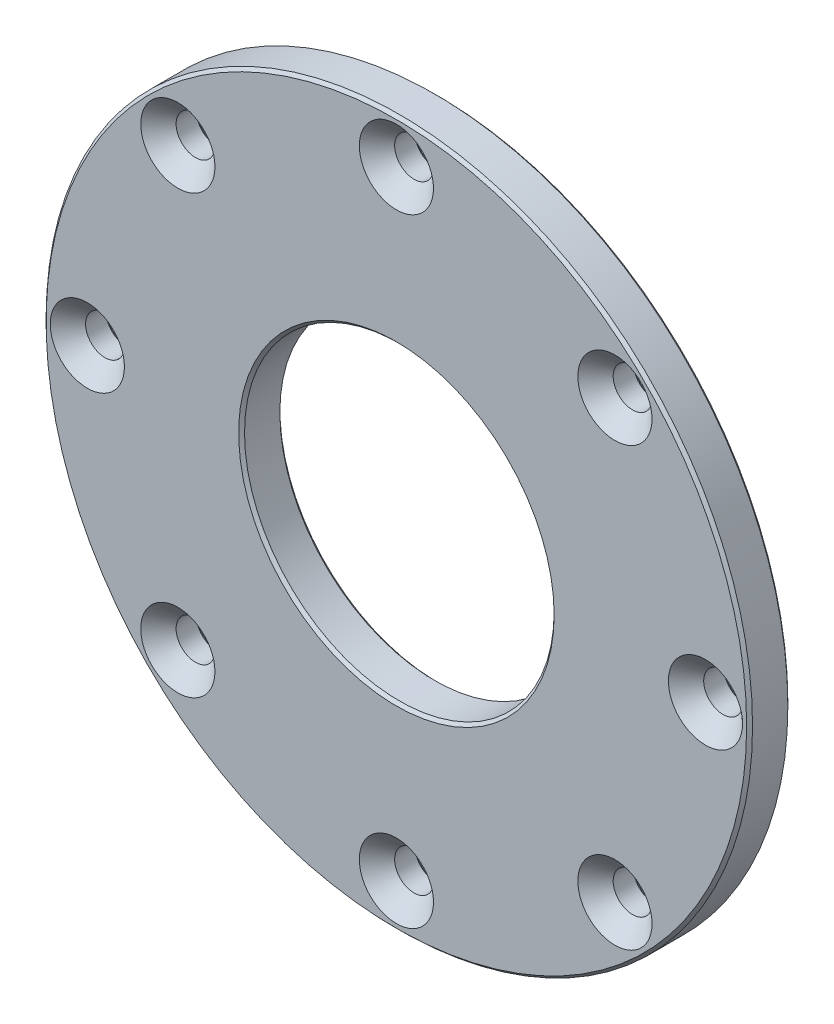
ISO-10303-21;
HEADER;
FILE_DESCRIPTION(('STEP AP214'),'2;1');
FILE_NAME('part.step','',(''),(''),'','','');
FILE_SCHEMA(('AUTOMOTIVE_DESIGN { 1 0 10303 214 1 1 1 1 }'));
ENDSEC;
DATA;
#1=APPLICATION_CONTEXT('core data for automotive mechanical design processes');
#2=APPLICATION_PROTOCOL_DEFINITION('international standard','automotive_design',2000,#1);
#3=PRODUCT_CONTEXT('',#1,'mechanical');
#4=PRODUCT('Part','Part','',(#3));
#5=PRODUCT_RELATED_PRODUCT_CATEGORY('part','',(#4));
#6=PRODUCT_DEFINITION_FORMATION('','',#4);
#7=PRODUCT_DEFINITION_CONTEXT('part definition',#1,'design');
#8=PRODUCT_DEFINITION('design','',#6,#7);
#9=PRODUCT_DEFINITION_SHAPE('','',#8);
#10=(LENGTH_UNIT() NAMED_UNIT(*) SI_UNIT(.MILLI.,.METRE.));
#11=(NAMED_UNIT(*) PLANE_ANGLE_UNIT() SI_UNIT($,.RADIAN.));
#12=(NAMED_UNIT(*) SI_UNIT($,.STERADIAN.) SOLID_ANGLE_UNIT());
#13=UNCERTAINTY_MEASURE_WITH_UNIT(LENGTH_MEASURE(1.E-05),#10,'distance_accuracy_value','');
#14=(GEOMETRIC_REPRESENTATION_CONTEXT(3) GLOBAL_UNCERTAINTY_ASSIGNED_CONTEXT((#13)) GLOBAL_UNIT_ASSIGNED_CONTEXT((#10,
#11,#12)) REPRESENTATION_CONTEXT('',''));
#15=CARTESIAN_POINT('',(0.,0.,0.));
#16=DIRECTION('',(0.,0.,1.));
#17=DIRECTION('',(1.,0.,0.));
#18=AXIS2_PLACEMENT_3D('',#15,#16,#17);
#19=CARTESIAN_POINT('',(0.,0.,7.));
#20=DIRECTION('',(0.,0.,1.));
#21=DIRECTION('',(1.,0.,0.));
#22=AXIS2_PLACEMENT_3D('',#19,#20,#21);
#23=PLANE('',#22);
#24=CARTESIAN_POINT('',(0.,0.,7.));
#25=DIRECTION('',(0.,0.,1.));
#26=DIRECTION('',(1.,0.,0.));
#27=AXIS2_PLACEMENT_3D('',#24,#25,#26);
#28=CIRCLE('',#27,59.5);
#29=CARTESIAN_POINT('',(59.5,0.,7.));
#30=VERTEX_POINT('',#29);
#31=EDGE_CURVE('E63',#30,#30,#28,.T.);
#32=ORIENTED_EDGE('',*,*,#31,.T.);
#33=EDGE_LOOP('',(#32));
#34=FACE_BOUND('',#33,.T.);
#35=CARTESIAN_POINT('',(0.,0.,7.));
#36=DIRECTION('',(0.,0.,1.));
#37=DIRECTION('',(1.,0.,0.));
#38=AXIS2_PLACEMENT_3D('',#35,#36,#37);
#39=CIRCLE('',#38,26.8);
#40=CARTESIAN_POINT('',(26.8,0.,7.));
#41=VERTEX_POINT('',#40);
#42=EDGE_CURVE('E70',#41,#41,#39,.F.);
#43=ORIENTED_EDGE('',*,*,#42,.T.);
#44=EDGE_LOOP('',(#43));
#45=FACE_BOUND('',#44,.T.);
#46=CARTESIAN_POINT('',(0.,52.5,7.));
#47=DIRECTION('',(0.,0.,1.));
#48=DIRECTION('',(1.,0.,0.));
#49=AXIS2_PLACEMENT_3D('',#46,#47,#48);
#50=CIRCLE('',#49,6.3);
#51=CARTESIAN_POINT('',(6.3,52.5,7.));
#52=VERTEX_POINT('',#51);
#53=EDGE_CURVE('E216',#52,#52,#50,.T.);
#54=ORIENTED_EDGE('',*,*,#53,.F.);
#55=EDGE_LOOP('',(#54));
#56=FACE_BOUND('',#55,.T.);
#57=CARTESIAN_POINT('',(37.1231060122937,37.1231060122937,7.));
#58=DIRECTION('',(0.,0.,1.));
#59=DIRECTION('',(1.,0.,0.));
#60=AXIS2_PLACEMENT_3D('',#57,#58,#59);
#61=CIRCLE('',#60,6.3);
#62=CARTESIAN_POINT('',(43.4231060122937,37.1231060122937,7.));
#63=VERTEX_POINT('',#62);
#64=EDGE_CURVE('E208',#63,#63,#61,.T.);
#65=ORIENTED_EDGE('',*,*,#64,.F.);
#66=EDGE_LOOP('',(#65));
#67=FACE_BOUND('',#66,.T.);
#68=CARTESIAN_POINT('',(52.5,0.,7.));
#69=DIRECTION('',(0.,0.,1.));
#70=DIRECTION('',(1.,0.,0.));
#71=AXIS2_PLACEMENT_3D('',#68,#69,#70);
#72=CIRCLE('',#71,6.3);
#73=CARTESIAN_POINT('',(58.8,0.,7.));
#74=VERTEX_POINT('',#73);
#75=EDGE_CURVE('E200',#74,#74,#72,.T.);
#76=ORIENTED_EDGE('',*,*,#75,.F.);
#77=EDGE_LOOP('',(#76));
#78=FACE_BOUND('',#77,.T.);
#79=CARTESIAN_POINT('',(37.1231060122937,-37.1231060122937,7.));
#80=DIRECTION('',(0.,0.,1.));
#81=DIRECTION('',(1.,0.,0.));
#82=AXIS2_PLACEMENT_3D('',#79,#80,#81);
#83=CIRCLE('',#82,6.3);
#84=CARTESIAN_POINT('',(43.4231060122937,-37.1231060122937,7.));
#85=VERTEX_POINT('',#84);
#86=EDGE_CURVE('E192',#85,#85,#83,.T.);
#87=ORIENTED_EDGE('',*,*,#86,.F.);
#88=EDGE_LOOP('',(#87));
#89=FACE_BOUND('',#88,.T.);
#90=CARTESIAN_POINT('',(0.,-52.5,7.));
#91=DIRECTION('',(0.,0.,1.));
#92=DIRECTION('',(1.,0.,0.));
#93=AXIS2_PLACEMENT_3D('',#90,#91,#92);
#94=CIRCLE('',#93,6.3);
#95=CARTESIAN_POINT('',(6.30000000000001,-52.5,7.));
#96=VERTEX_POINT('',#95);
#97=EDGE_CURVE('E184',#96,#96,#94,.T.);
#98=ORIENTED_EDGE('',*,*,#97,.F.);
#99=EDGE_LOOP('',(#98));
#100=FACE_BOUND('',#99,.T.);
#101=CARTESIAN_POINT('',(-37.1231060122937,-37.1231060122938,7.));
#102=DIRECTION('',(0.,0.,1.));
#103=DIRECTION('',(1.,0.,0.));
#104=AXIS2_PLACEMENT_3D('',#101,#102,#103);
#105=CIRCLE('',#104,6.3);
#106=CARTESIAN_POINT('',(-30.8231060122937,-37.1231060122938,7.));
#107=VERTEX_POINT('',#106);
#108=EDGE_CURVE('E176',#107,#107,#105,.T.);
#109=ORIENTED_EDGE('',*,*,#108,.F.);
#110=EDGE_LOOP('',(#109));
#111=FACE_BOUND('',#110,.T.);
#112=CARTESIAN_POINT('',(-52.5,0.,7.));
#113=DIRECTION('',(0.,0.,1.));
#114=DIRECTION('',(1.,0.,0.));
#115=AXIS2_PLACEMENT_3D('',#112,#113,#114);
#116=CIRCLE('',#115,6.3);
#117=CARTESIAN_POINT('',(-46.2,0.,7.));
#118=VERTEX_POINT('',#117);
#119=EDGE_CURVE('E168',#118,#118,#116,.T.);
#120=ORIENTED_EDGE('',*,*,#119,.F.);
#121=EDGE_LOOP('',(#120));
#122=FACE_BOUND('',#121,.T.);
#123=CARTESIAN_POINT('',(-37.1231060122937,37.1231060122937,7.));
#124=DIRECTION('',(0.,0.,1.));
#125=DIRECTION('',(1.,0.,0.));
#126=AXIS2_PLACEMENT_3D('',#123,#124,#125);
#127=CIRCLE('',#126,6.3);
#128=CARTESIAN_POINT('',(-30.8231060122937,37.1231060122937,7.));
#129=VERTEX_POINT('',#128);
#130=EDGE_CURVE('E160',#129,#129,#127,.T.);
#131=ORIENTED_EDGE('',*,*,#130,.F.);
#132=EDGE_LOOP('',(#131));
#133=FACE_BOUND('',#132,.T.);
#134=ADVANCED_FACE('F47',(#34,#45,#56,#67,#78,#89,#100,#111,#122,#133),#23,.T.);
#135=CARTESIAN_POINT('',(0.,0.,0.));
#136=DIRECTION('',(0.,0.,1.));
#137=DIRECTION('',(1.,0.,0.));
#138=AXIS2_PLACEMENT_3D('',#135,#136,#137);
#139=PLANE('',#138);
#140=CARTESIAN_POINT('',(-37.1231060122937,37.1231060122937,0.));
#141=DIRECTION('',(0.,0.,1.));
#142=DIRECTION('',(1.,0.,0.));
#143=AXIS2_PLACEMENT_3D('',#140,#141,#142);
#144=CIRCLE('',#143,3.79999999999998);
#145=CARTESIAN_POINT('',(-33.3231060122938,37.1231060122937,0.));
#146=VERTEX_POINT('',#145);
#147=EDGE_CURVE('E116',#146,#146,#144,.T.);
#148=ORIENTED_EDGE('',*,*,#147,.T.);
#149=EDGE_LOOP('',(#148));
#150=FACE_BOUND('',#149,.T.);
#151=CARTESIAN_POINT('',(-52.5,0.,0.));
#152=DIRECTION('',(0.,0.,1.));
#153=DIRECTION('',(1.,0.,0.));
#154=AXIS2_PLACEMENT_3D('',#151,#152,#153);
#155=CIRCLE('',#154,3.79999999999998);
#156=CARTESIAN_POINT('',(-48.7,0.,0.));
#157=VERTEX_POINT('',#156);
#158=EDGE_CURVE('E120',#157,#157,#155,.T.);
#159=ORIENTED_EDGE('',*,*,#158,.T.);
#160=EDGE_LOOP('',(#159));
#161=FACE_BOUND('',#160,.T.);
#162=CARTESIAN_POINT('',(-37.1231060122937,-37.1231060122938,0.));
#163=DIRECTION('',(0.,0.,1.));
#164=DIRECTION('',(1.,0.,0.));
#165=AXIS2_PLACEMENT_3D('',#162,#163,#164);
#166=CIRCLE('',#165,3.79999999999998);
#167=CARTESIAN_POINT('',(-33.3231060122938,-37.1231060122938,0.));
#168=VERTEX_POINT('',#167);
#169=EDGE_CURVE('E124',#168,#168,#166,.T.);
#170=ORIENTED_EDGE('',*,*,#169,.T.);
#171=EDGE_LOOP('',(#170));
#172=FACE_BOUND('',#171,.T.);
#173=CARTESIAN_POINT('',(0.,-52.5,0.));
#174=DIRECTION('',(0.,0.,1.));
#175=DIRECTION('',(1.,0.,0.));
#176=AXIS2_PLACEMENT_3D('',#173,#174,#175);
#177=CIRCLE('',#176,3.8);
#178=CARTESIAN_POINT('',(3.80000000000001,-52.5,0.));
#179=VERTEX_POINT('',#178);
#180=EDGE_CURVE('E128',#179,#179,#177,.T.);
#181=ORIENTED_EDGE('',*,*,#180,.T.);
#182=EDGE_LOOP('',(#181));
#183=FACE_BOUND('',#182,.T.);
#184=CARTESIAN_POINT('',(37.1231060122937,-37.1231060122937,0.));
#185=DIRECTION('',(0.,0.,1.));
#186=DIRECTION('',(1.,0.,0.));
#187=AXIS2_PLACEMENT_3D('',#184,#185,#186);
#188=CIRCLE('',#187,3.79999999999998);
#189=CARTESIAN_POINT('',(40.9231060122937,-37.1231060122937,0.));
#190=VERTEX_POINT('',#189);
#191=EDGE_CURVE('E132',#190,#190,#188,.T.);
#192=ORIENTED_EDGE('',*,*,#191,.T.);
#193=EDGE_LOOP('',(#192));
#194=FACE_BOUND('',#193,.T.);
#195=CARTESIAN_POINT('',(52.5,0.,0.));
#196=DIRECTION('',(0.,0.,1.));
#197=DIRECTION('',(1.,0.,0.));
#198=AXIS2_PLACEMENT_3D('',#195,#196,#197);
#199=CIRCLE('',#198,3.79999999999998);
#200=CARTESIAN_POINT('',(56.3,0.,0.));
#201=VERTEX_POINT('',#200);
#202=EDGE_CURVE('E136',#201,#201,#199,.T.);
#203=ORIENTED_EDGE('',*,*,#202,.T.);
#204=EDGE_LOOP('',(#203));
#205=FACE_BOUND('',#204,.T.);
#206=CARTESIAN_POINT('',(37.1231060122937,37.1231060122937,0.));
#207=DIRECTION('',(0.,0.,1.));
#208=DIRECTION('',(1.,0.,0.));
#209=AXIS2_PLACEMENT_3D('',#206,#207,#208);
#210=CIRCLE('',#209,3.79999999999998);
#211=CARTESIAN_POINT('',(40.9231060122937,37.1231060122937,0.));
#212=VERTEX_POINT('',#211);
#213=EDGE_CURVE('E140',#212,#212,#210,.T.);
#214=ORIENTED_EDGE('',*,*,#213,.T.);
#215=EDGE_LOOP('',(#214));
#216=FACE_BOUND('',#215,.T.);
#217=CARTESIAN_POINT('',(0.,52.5,0.));
#218=DIRECTION('',(0.,0.,1.));
#219=DIRECTION('',(1.,0.,0.));
#220=AXIS2_PLACEMENT_3D('',#217,#218,#219);
#221=CIRCLE('',#220,3.8);
#222=CARTESIAN_POINT('',(3.79999999999999,52.5,0.));
#223=VERTEX_POINT('',#222);
#224=EDGE_CURVE('E144',#223,#223,#221,.T.);
#225=ORIENTED_EDGE('',*,*,#224,.T.);
#226=EDGE_LOOP('',(#225));
#227=FACE_BOUND('',#226,.T.);
#228=CARTESIAN_POINT('',(0.,0.,0.));
#229=DIRECTION('',(0.,0.,1.));
#230=DIRECTION('',(1.,0.,0.));
#231=AXIS2_PLACEMENT_3D('',#228,#229,#230);
#232=CIRCLE('',#231,59.5);
#233=CARTESIAN_POINT('',(59.5,0.,0.));
#234=VERTEX_POINT('',#233);
#235=EDGE_CURVE('E148',#234,#234,#232,.F.);
#236=ORIENTED_EDGE('',*,*,#235,.T.);
#237=EDGE_LOOP('',(#236));
#238=FACE_BOUND('',#237,.T.);
#239=CARTESIAN_POINT('',(0.,0.,0.));
#240=DIRECTION('',(0.,0.,1.));
#241=DIRECTION('',(1.,0.,0.));
#242=AXIS2_PLACEMENT_3D('',#239,#240,#241);
#243=CIRCLE('',#242,26.8);
#244=CARTESIAN_POINT('',(26.8,0.,0.));
#245=VERTEX_POINT('',#244);
#246=EDGE_CURVE('E152',#245,#245,#243,.T.);
#247=ORIENTED_EDGE('',*,*,#246,.T.);
#248=EDGE_LOOP('',(#247));
#249=FACE_BOUND('',#248,.T.);
#250=ADVANCED_FACE('F227',(#150,#161,#172,#183,#194,#205,#216,#227,#238,#249),#139,.F.);
#251=CARTESIAN_POINT('',(0.,0.,7.));
#252=DIRECTION('',(0.,0.,-1.));
#253=DIRECTION('',(-1.,0.,0.));
#254=AXIS2_PLACEMENT_3D('',#251,#252,#253);
#255=CYLINDRICAL_SURFACE('',#254,60.);
#256=CARTESIAN_POINT('',(0.,0.,0.499999999999994));
#257=DIRECTION('',(0.,0.,1.));
#258=DIRECTION('',(1.,0.,0.));
#259=AXIS2_PLACEMENT_3D('',#256,#257,#258);
#260=CIRCLE('',#259,60.);
#261=CARTESIAN_POINT('',(60.,0.,0.499999999999994));
#262=VERTEX_POINT('',#261);
#263=EDGE_CURVE('E76',#262,#262,#260,.T.);
#264=ORIENTED_EDGE('',*,*,#263,.T.);
#265=EDGE_LOOP('',(#264));
#266=FACE_BOUND('',#265,.T.);
#267=CARTESIAN_POINT('',(0.,0.,6.50000000000005));
#268=DIRECTION('',(0.,0.,1.));
#269=DIRECTION('',(1.,0.,0.));
#270=AXIS2_PLACEMENT_3D('',#267,#268,#269);
#271=CIRCLE('',#270,60.);
#272=CARTESIAN_POINT('',(60.,0.,6.50000000000005));
#273=VERTEX_POINT('',#272);
#274=EDGE_CURVE('E80',#273,#273,#271,.F.);
#275=ORIENTED_EDGE('',*,*,#274,.T.);
#276=EDGE_LOOP('',(#275));
#277=FACE_BOUND('',#276,.T.);
#278=ADVANCED_FACE('F265',(#266,#277),#255,.T.);
#279=CARTESIAN_POINT('',(0.,0.,7.));
#280=DIRECTION('',(0.,0.,-1.));
#281=DIRECTION('',(-1.,0.,0.));
#282=AXIS2_PLACEMENT_3D('',#279,#280,#281);
#283=CYLINDRICAL_SURFACE('',#282,26.3);
#284=CARTESIAN_POINT('',(0.,0.,0.500000000000035));
#285=DIRECTION('',(0.,0.,1.));
#286=DIRECTION('',(1.,0.,0.));
#287=AXIS2_PLACEMENT_3D('',#284,#285,#286);
#288=CIRCLE('',#287,26.3);
#289=CARTESIAN_POINT('',(26.3,0.,0.500000000000035));
#290=VERTEX_POINT('',#289);
#291=EDGE_CURVE('E10',#290,#290,#288,.F.);
#292=ORIENTED_EDGE('',*,*,#291,.T.);
#293=EDGE_LOOP('',(#292));
#294=FACE_BOUND('',#293,.T.);
#295=CARTESIAN_POINT('',(0.,0.,6.5));
#296=DIRECTION('',(0.,0.,1.));
#297=DIRECTION('',(1.,0.,0.));
#298=AXIS2_PLACEMENT_3D('',#295,#296,#297);
#299=CIRCLE('',#298,26.3);
#300=CARTESIAN_POINT('',(26.3,0.,6.5));
#301=VERTEX_POINT('',#300);
#302=EDGE_CURVE('E56',#301,#301,#299,.T.);
#303=ORIENTED_EDGE('',*,*,#302,.T.);
#304=EDGE_LOOP('',(#303));
#305=FACE_BOUND('',#304,.T.);
#306=ADVANCED_FACE('F258',(#294,#305),#283,.F.);
#307=CARTESIAN_POINT('',(-37.1231060122937,37.1231060122937,7.));
#308=DIRECTION('',(0.,0.,1.));
#309=DIRECTION('',(1.,0.,0.));
#310=AXIS2_PLACEMENT_3D('',#307,#308,#309);
#311=CYLINDRICAL_SURFACE('',#310,3.3);
#312=CARTESIAN_POINT('',(-37.1231060122937,37.1231060122937,0.499999999999984));
#313=DIRECTION('',(0.,0.,1.));
#314=DIRECTION('',(1.,0.,0.));
#315=AXIS2_PLACEMENT_3D('',#312,#313,#314);
#316=CIRCLE('',#315,3.3);
#317=CARTESIAN_POINT('',(-33.8231060122937,37.1231060122937,0.499999999999984));
#318=VERTEX_POINT('',#317);
#319=EDGE_CURVE('E112',#318,#318,#316,.F.);
#320=ORIENTED_EDGE('',*,*,#319,.T.);
#321=EDGE_LOOP('',(#320));
#322=FACE_BOUND('',#321,.T.);
#323=CARTESIAN_POINT('',(-37.1231060122937,37.1231060122937,4.));
#324=DIRECTION('',(0.,0.,1.));
#325=DIRECTION('',(1.,0.,0.));
#326=AXIS2_PLACEMENT_3D('',#323,#324,#325);
#327=CIRCLE('',#326,3.3);
#328=CARTESIAN_POINT('',(-33.8231060122937,37.1231060122937,4.));
#329=VERTEX_POINT('',#328);
#330=EDGE_CURVE('E156',#329,#329,#327,.T.);
#331=ORIENTED_EDGE('',*,*,#330,.T.);
#332=EDGE_LOOP('',(#331));
#333=FACE_BOUND('',#332,.T.);
#334=ADVANCED_FACE('F247',(#322,#333),#311,.F.);
#335=CARTESIAN_POINT('',(-37.1231060122937,37.1231060122937,7.));
#336=DIRECTION('',(0.,0.,1.));
#337=DIRECTION('',(1.,0.,0.));
#338=AXIS2_PLACEMENT_3D('',#335,#336,#337);
#339=CONICAL_SURFACE('',#338,6.3,0.785398163397449);
#340=ORIENTED_EDGE('',*,*,#330,.F.);
#341=EDGE_LOOP('',(#340));
#342=FACE_BOUND('',#341,.T.);
#343=ORIENTED_EDGE('',*,*,#130,.T.);
#344=EDGE_LOOP('',(#343));
#345=FACE_BOUND('',#344,.T.);
#346=ADVANCED_FACE('F244',(#342,#345),#339,.F.);
#347=CARTESIAN_POINT('',(-52.5,0.,7.));
#348=DIRECTION('',(0.,0.,1.));
#349=DIRECTION('',(1.,0.,0.));
#350=AXIS2_PLACEMENT_3D('',#347,#348,#349);
#351=CYLINDRICAL_SURFACE('',#350,3.3);
#352=CARTESIAN_POINT('',(-52.5,0.,0.499999999999984));
#353=DIRECTION('',(0.,0.,1.));
#354=DIRECTION('',(1.,0.,0.));
#355=AXIS2_PLACEMENT_3D('',#352,#353,#354);
#356=CIRCLE('',#355,3.3);
#357=CARTESIAN_POINT('',(-49.2,0.,0.499999999999984));
#358=VERTEX_POINT('',#357);
#359=EDGE_CURVE('E108',#358,#358,#356,.F.);
#360=ORIENTED_EDGE('',*,*,#359,.T.);
#361=EDGE_LOOP('',(#360));
#362=FACE_BOUND('',#361,.T.);
#363=CARTESIAN_POINT('',(-52.5,0.,4.));
#364=DIRECTION('',(0.,0.,1.));
#365=DIRECTION('',(1.,0.,0.));
#366=AXIS2_PLACEMENT_3D('',#363,#364,#365);
#367=CIRCLE('',#366,3.3);
#368=CARTESIAN_POINT('',(-49.2,0.,4.));
#369=VERTEX_POINT('',#368);
#370=EDGE_CURVE('E164',#369,#369,#367,.T.);
#371=ORIENTED_EDGE('',*,*,#370,.T.);
#372=EDGE_LOOP('',(#371));
#373=FACE_BOUND('',#372,.T.);
#374=ADVANCED_FACE('F246',(#362,#373),#351,.F.);
#375=CARTESIAN_POINT('',(-52.5,0.,7.));
#376=DIRECTION('',(0.,0.,1.));
#377=DIRECTION('',(1.,0.,0.));
#378=AXIS2_PLACEMENT_3D('',#375,#376,#377);
#379=CONICAL_SURFACE('',#378,6.3,0.785398163397449);
#380=ORIENTED_EDGE('',*,*,#370,.F.);
#381=EDGE_LOOP('',(#380));
#382=FACE_BOUND('',#381,.T.);
#383=ORIENTED_EDGE('',*,*,#119,.T.);
#384=EDGE_LOOP('',(#383));
#385=FACE_BOUND('',#384,.T.);
#386=ADVANCED_FACE('F254',(#382,#385),#379,.F.);
#387=CARTESIAN_POINT('',(-37.1231060122937,-37.1231060122938,7.));
#388=DIRECTION('',(0.,0.,1.));
#389=DIRECTION('',(1.,0.,0.));
#390=AXIS2_PLACEMENT_3D('',#387,#388,#389);
#391=CYLINDRICAL_SURFACE('',#390,3.3);
#392=CARTESIAN_POINT('',(-37.1231060122937,-37.1231060122938,0.499999999999984));
#393=DIRECTION('',(0.,0.,1.));
#394=DIRECTION('',(1.,0.,0.));
#395=AXIS2_PLACEMENT_3D('',#392,#393,#394);
#396=CIRCLE('',#395,3.3);
#397=CARTESIAN_POINT('',(-33.8231060122937,-37.1231060122938,0.499999999999984));
#398=VERTEX_POINT('',#397);
#399=EDGE_CURVE('E104',#398,#398,#396,.F.);
#400=ORIENTED_EDGE('',*,*,#399,.T.);
#401=EDGE_LOOP('',(#400));
#402=FACE_BOUND('',#401,.T.);
#403=CARTESIAN_POINT('',(-37.1231060122937,-37.1231060122938,4.));
#404=DIRECTION('',(0.,0.,1.));
#405=DIRECTION('',(1.,0.,0.));
#406=AXIS2_PLACEMENT_3D('',#403,#404,#405);
#407=CIRCLE('',#406,3.3);
#408=CARTESIAN_POINT('',(-33.8231060122937,-37.1231060122938,4.));
#409=VERTEX_POINT('',#408);
#410=EDGE_CURVE('E172',#409,#409,#407,.T.);
#411=ORIENTED_EDGE('',*,*,#410,.T.);
#412=EDGE_LOOP('',(#411));
#413=FACE_BOUND('',#412,.T.);
#414=ADVANCED_FACE('F535',(#402,#413),#391,.F.);
#415=CARTESIAN_POINT('',(-37.1231060122937,-37.1231060122938,7.));
#416=DIRECTION('',(0.,0.,1.));
#417=DIRECTION('',(1.,0.,0.));
#418=AXIS2_PLACEMENT_3D('',#415,#416,#417);
#419=CONICAL_SURFACE('',#418,6.3,0.785398163397449);
#420=ORIENTED_EDGE('',*,*,#410,.F.);
#421=EDGE_LOOP('',(#420));
#422=FACE_BOUND('',#421,.T.);
#423=ORIENTED_EDGE('',*,*,#108,.T.);
#424=EDGE_LOOP('',(#423));
#425=FACE_BOUND('',#424,.T.);
#426=ADVANCED_FACE('F525',(#422,#425),#419,.F.);
#427=CARTESIAN_POINT('',(0.,-52.5,7.));
#428=DIRECTION('',(0.,0.,1.));
#429=DIRECTION('',(1.,0.,0.));
#430=AXIS2_PLACEMENT_3D('',#427,#428,#429);
#431=CYLINDRICAL_SURFACE('',#430,3.3);
#432=CARTESIAN_POINT('',(0.,-52.5,0.500000000000015));
#433=DIRECTION('',(0.,0.,1.));
#434=DIRECTION('',(1.,0.,0.));
#435=AXIS2_PLACEMENT_3D('',#432,#433,#434);
#436=CIRCLE('',#435,3.3);
#437=CARTESIAN_POINT('',(3.30000000000001,-52.5,0.500000000000015));
#438=VERTEX_POINT('',#437);
#439=EDGE_CURVE('E100',#438,#438,#436,.F.);
#440=ORIENTED_EDGE('',*,*,#439,.T.);
#441=EDGE_LOOP('',(#440));
#442=FACE_BOUND('',#441,.T.);
#443=CARTESIAN_POINT('',(0.,-52.5,4.));
#444=DIRECTION('',(0.,0.,1.));
#445=DIRECTION('',(1.,0.,0.));
#446=AXIS2_PLACEMENT_3D('',#443,#444,#445);
#447=CIRCLE('',#446,3.3);
#448=CARTESIAN_POINT('',(3.30000000000001,-52.5,4.));
#449=VERTEX_POINT('',#448);
#450=EDGE_CURVE('E180',#449,#449,#447,.T.);
#451=ORIENTED_EDGE('',*,*,#450,.T.);
#452=EDGE_LOOP('',(#451));
#453=FACE_BOUND('',#452,.T.);
#454=ADVANCED_FACE('F515',(#442,#453),#431,.F.);
#455=CARTESIAN_POINT('',(0.,-52.5,7.));
#456=DIRECTION('',(0.,0.,1.));
#457=DIRECTION('',(1.,0.,0.));
#458=AXIS2_PLACEMENT_3D('',#455,#456,#457);
#459=CONICAL_SURFACE('',#458,6.3,0.785398163397448);
#460=ORIENTED_EDGE('',*,*,#450,.F.);
#461=EDGE_LOOP('',(#460));
#462=FACE_BOUND('',#461,.T.);
#463=ORIENTED_EDGE('',*,*,#97,.T.);
#464=EDGE_LOOP('',(#463));
#465=FACE_BOUND('',#464,.T.);
#466=ADVANCED_FACE('F505',(#462,#465),#459,.F.);
#467=CARTESIAN_POINT('',(37.1231060122937,-37.1231060122937,7.));
#468=DIRECTION('',(0.,0.,1.));
#469=DIRECTION('',(1.,0.,0.));
#470=AXIS2_PLACEMENT_3D('',#467,#468,#469);
#471=CYLINDRICAL_SURFACE('',#470,3.3);
#472=CARTESIAN_POINT('',(37.1231060122937,-37.1231060122937,0.499999999999984));
#473=DIRECTION('',(0.,0.,1.));
#474=DIRECTION('',(1.,0.,0.));
#475=AXIS2_PLACEMENT_3D('',#472,#473,#474);
#476=CIRCLE('',#475,3.3);
#477=CARTESIAN_POINT('',(40.4231060122937,-37.1231060122937,0.499999999999984));
#478=VERTEX_POINT('',#477);
#479=EDGE_CURVE('E96',#478,#478,#476,.F.);
#480=ORIENTED_EDGE('',*,*,#479,.T.);
#481=EDGE_LOOP('',(#480));
#482=FACE_BOUND('',#481,.T.);
#483=CARTESIAN_POINT('',(37.1231060122937,-37.1231060122937,4.));
#484=DIRECTION('',(0.,0.,1.));
#485=DIRECTION('',(1.,0.,0.));
#486=AXIS2_PLACEMENT_3D('',#483,#484,#485);
#487=CIRCLE('',#486,3.3);
#488=CARTESIAN_POINT('',(40.4231060122937,-37.1231060122937,4.));
#489=VERTEX_POINT('',#488);
#490=EDGE_CURVE('E188',#489,#489,#487,.T.);
#491=ORIENTED_EDGE('',*,*,#490,.T.);
#492=EDGE_LOOP('',(#491));
#493=FACE_BOUND('',#492,.T.);
#494=ADVANCED_FACE('F495',(#482,#493),#471,.F.);
#495=CARTESIAN_POINT('',(37.1231060122937,-37.1231060122937,7.));
#496=DIRECTION('',(0.,0.,1.));
#497=DIRECTION('',(1.,0.,0.));
#498=AXIS2_PLACEMENT_3D('',#495,#496,#497);
#499=CONICAL_SURFACE('',#498,6.3,0.785398163397449);
#500=ORIENTED_EDGE('',*,*,#490,.F.);
#501=EDGE_LOOP('',(#500));
#502=FACE_BOUND('',#501,.T.);
#503=ORIENTED_EDGE('',*,*,#86,.T.);
#504=EDGE_LOOP('',(#503));
#505=FACE_BOUND('',#504,.T.);
#506=ADVANCED_FACE('F485',(#502,#505),#499,.F.);
#507=CARTESIAN_POINT('',(52.5,0.,7.));
#508=DIRECTION('',(0.,0.,1.));
#509=DIRECTION('',(1.,0.,0.));
#510=AXIS2_PLACEMENT_3D('',#507,#508,#509);
#511=CYLINDRICAL_SURFACE('',#510,3.3);
#512=CARTESIAN_POINT('',(52.5,0.,0.499999999999984));
#513=DIRECTION('',(0.,0.,1.));
#514=DIRECTION('',(1.,0.,0.));
#515=AXIS2_PLACEMENT_3D('',#512,#513,#514);
#516=CIRCLE('',#515,3.3);
#517=CARTESIAN_POINT('',(55.8,0.,0.499999999999984));
#518=VERTEX_POINT('',#517);
#519=EDGE_CURVE('E92',#518,#518,#516,.F.);
#520=ORIENTED_EDGE('',*,*,#519,.T.);
#521=EDGE_LOOP('',(#520));
#522=FACE_BOUND('',#521,.T.);
#523=CARTESIAN_POINT('',(52.5,0.,4.));
#524=DIRECTION('',(0.,0.,1.));
#525=DIRECTION('',(1.,0.,0.));
#526=AXIS2_PLACEMENT_3D('',#523,#524,#525);
#527=CIRCLE('',#526,3.3);
#528=CARTESIAN_POINT('',(55.8,0.,4.));
#529=VERTEX_POINT('',#528);
#530=EDGE_CURVE('E196',#529,#529,#527,.T.);
#531=ORIENTED_EDGE('',*,*,#530,.T.);
#532=EDGE_LOOP('',(#531));
#533=FACE_BOUND('',#532,.T.);
#534=ADVANCED_FACE('F475',(#522,#533),#511,.F.);
#535=CARTESIAN_POINT('',(52.5,0.,7.));
#536=DIRECTION('',(0.,0.,1.));
#537=DIRECTION('',(1.,0.,0.));
#538=AXIS2_PLACEMENT_3D('',#535,#536,#537);
#539=CONICAL_SURFACE('',#538,6.3,0.785398163397449);
#540=ORIENTED_EDGE('',*,*,#530,.F.);
#541=EDGE_LOOP('',(#540));
#542=FACE_BOUND('',#541,.T.);
#543=ORIENTED_EDGE('',*,*,#75,.T.);
#544=EDGE_LOOP('',(#543));
#545=FACE_BOUND('',#544,.T.);
#546=ADVANCED_FACE('F465',(#542,#545),#539,.F.);
#547=CARTESIAN_POINT('',(37.1231060122937,37.1231060122937,7.));
#548=DIRECTION('',(0.,0.,1.));
#549=DIRECTION('',(1.,0.,0.));
#550=AXIS2_PLACEMENT_3D('',#547,#548,#549);
#551=CYLINDRICAL_SURFACE('',#550,3.3);
#552=CARTESIAN_POINT('',(37.1231060122937,37.1231060122937,0.499999999999984));
#553=DIRECTION('',(0.,0.,1.));
#554=DIRECTION('',(1.,0.,0.));
#555=AXIS2_PLACEMENT_3D('',#552,#553,#554);
#556=CIRCLE('',#555,3.3);
#557=CARTESIAN_POINT('',(40.4231060122937,37.1231060122937,0.499999999999984));
#558=VERTEX_POINT('',#557);
#559=EDGE_CURVE('E88',#558,#558,#556,.F.);
#560=ORIENTED_EDGE('',*,*,#559,.T.);
#561=EDGE_LOOP('',(#560));
#562=FACE_BOUND('',#561,.T.);
#563=CARTESIAN_POINT('',(37.1231060122937,37.1231060122937,4.));
#564=DIRECTION('',(0.,0.,1.));
#565=DIRECTION('',(1.,0.,0.));
#566=AXIS2_PLACEMENT_3D('',#563,#564,#565);
#567=CIRCLE('',#566,3.3);
#568=CARTESIAN_POINT('',(40.4231060122937,37.1231060122937,4.));
#569=VERTEX_POINT('',#568);
#570=EDGE_CURVE('E204',#569,#569,#567,.T.);
#571=ORIENTED_EDGE('',*,*,#570,.T.);
#572=EDGE_LOOP('',(#571));
#573=FACE_BOUND('',#572,.T.);
#574=ADVANCED_FACE('F455',(#562,#573),#551,.F.);
#575=CARTESIAN_POINT('',(37.1231060122937,37.1231060122937,7.));
#576=DIRECTION('',(0.,0.,1.));
#577=DIRECTION('',(1.,0.,0.));
#578=AXIS2_PLACEMENT_3D('',#575,#576,#577);
#579=CONICAL_SURFACE('',#578,6.3,0.785398163397449);
#580=ORIENTED_EDGE('',*,*,#570,.F.);
#581=EDGE_LOOP('',(#580));
#582=FACE_BOUND('',#581,.T.);
#583=ORIENTED_EDGE('',*,*,#64,.T.);
#584=EDGE_LOOP('',(#583));
#585=FACE_BOUND('',#584,.T.);
#586=ADVANCED_FACE('F445',(#582,#585),#579,.F.);
#587=CARTESIAN_POINT('',(0.,52.5,7.));
#588=DIRECTION('',(0.,0.,1.));
#589=DIRECTION('',(1.,0.,0.));
#590=AXIS2_PLACEMENT_3D('',#587,#588,#589);
#591=CYLINDRICAL_SURFACE('',#590,3.3);
#592=CARTESIAN_POINT('',(0.,52.5,0.500000000000015));
#593=DIRECTION('',(0.,0.,1.));
#594=DIRECTION('',(1.,0.,0.));
#595=AXIS2_PLACEMENT_3D('',#592,#593,#594);
#596=CIRCLE('',#595,3.3);
#597=CARTESIAN_POINT('',(3.29999999999999,52.5,0.500000000000015));
#598=VERTEX_POINT('',#597);
#599=EDGE_CURVE('E84',#598,#598,#596,.F.);
#600=ORIENTED_EDGE('',*,*,#599,.T.);
#601=EDGE_LOOP('',(#600));
#602=FACE_BOUND('',#601,.T.);
#603=CARTESIAN_POINT('',(0.,52.5,4.));
#604=DIRECTION('',(0.,0.,1.));
#605=DIRECTION('',(1.,0.,0.));
#606=AXIS2_PLACEMENT_3D('',#603,#604,#605);
#607=CIRCLE('',#606,3.3);
#608=CARTESIAN_POINT('',(3.3,52.5,4.));
#609=VERTEX_POINT('',#608);
#610=EDGE_CURVE('E212',#609,#609,#607,.T.);
#611=ORIENTED_EDGE('',*,*,#610,.T.);
#612=EDGE_LOOP('',(#611));
#613=FACE_BOUND('',#612,.T.);
#614=ADVANCED_FACE('F435',(#602,#613),#591,.F.);
#615=CARTESIAN_POINT('',(0.,52.5,7.));
#616=DIRECTION('',(0.,0.,1.));
#617=DIRECTION('',(1.,0.,0.));
#618=AXIS2_PLACEMENT_3D('',#615,#616,#617);
#619=CONICAL_SURFACE('',#618,6.3,0.785398163397448);
#620=ORIENTED_EDGE('',*,*,#610,.F.);
#621=EDGE_LOOP('',(#620));
#622=FACE_BOUND('',#621,.T.);
#623=ORIENTED_EDGE('',*,*,#53,.T.);
#624=EDGE_LOOP('',(#623));
#625=FACE_BOUND('',#624,.T.);
#626=ADVANCED_FACE('F223',(#622,#625),#619,.F.);
#627=CARTESIAN_POINT('',(-37.1231060122937,37.1231060122937,0.));
#628=DIRECTION('',(0.,0.,-1.));
#629=DIRECTION('',(-1.,0.,0.));
#630=AXIS2_PLACEMENT_3D('',#627,#628,#629);
#631=CONICAL_SURFACE('',#630,3.79999999999998,0.785398163397451);
#632=ORIENTED_EDGE('',*,*,#319,.F.);
#633=EDGE_LOOP('',(#632));
#634=FACE_BOUND('',#633,.T.);
#635=ORIENTED_EDGE('',*,*,#147,.F.);
#636=EDGE_LOOP('',(#635));
#637=FACE_BOUND('',#636,.T.);
#638=ADVANCED_FACE('F274',(#634,#637),#631,.F.);
#639=CARTESIAN_POINT('',(-52.5,0.,0.));
#640=DIRECTION('',(0.,0.,-1.));
#641=DIRECTION('',(-1.,0.,0.));
#642=AXIS2_PLACEMENT_3D('',#639,#640,#641);
#643=CONICAL_SURFACE('',#642,3.79999999999998,0.785398163397451);
#644=ORIENTED_EDGE('',*,*,#359,.F.);
#645=EDGE_LOOP('',(#644));
#646=FACE_BOUND('',#645,.T.);
#647=ORIENTED_EDGE('',*,*,#158,.F.);
#648=EDGE_LOOP('',(#647));
#649=FACE_BOUND('',#648,.T.);
#650=ADVANCED_FACE('F280',(#646,#649),#643,.F.);
#651=CARTESIAN_POINT('',(-37.1231060122937,-37.1231060122938,0.));
#652=DIRECTION('',(0.,0.,-1.));
#653=DIRECTION('',(-1.,0.,0.));
#654=AXIS2_PLACEMENT_3D('',#651,#652,#653);
#655=CONICAL_SURFACE('',#654,3.79999999999998,0.785398163397451);
#656=ORIENTED_EDGE('',*,*,#399,.F.);
#657=EDGE_LOOP('',(#656));
#658=FACE_BOUND('',#657,.T.);
#659=ORIENTED_EDGE('',*,*,#169,.F.);
#660=EDGE_LOOP('',(#659));
#661=FACE_BOUND('',#660,.T.);
#662=ADVANCED_FACE('F287',(#658,#661),#655,.F.);
#663=CARTESIAN_POINT('',(0.,-52.5,0.));
#664=DIRECTION('',(0.,0.,-1.));
#665=DIRECTION('',(-1.,0.,0.));
#666=AXIS2_PLACEMENT_3D('',#663,#664,#665);
#667=CONICAL_SURFACE('',#666,3.8,0.785398163397432);
#668=ORIENTED_EDGE('',*,*,#439,.F.);
#669=EDGE_LOOP('',(#668));
#670=FACE_BOUND('',#669,.T.);
#671=ORIENTED_EDGE('',*,*,#180,.F.);
#672=EDGE_LOOP('',(#671));
#673=FACE_BOUND('',#672,.T.);
#674=ADVANCED_FACE('F294',(#670,#673),#667,.F.);
#675=CARTESIAN_POINT('',(37.1231060122937,-37.1231060122937,0.));
#676=DIRECTION('',(0.,0.,-1.));
#677=DIRECTION('',(-1.,0.,0.));
#678=AXIS2_PLACEMENT_3D('',#675,#676,#677);
#679=CONICAL_SURFACE('',#678,3.79999999999998,0.785398163397451);
#680=ORIENTED_EDGE('',*,*,#479,.F.);
#681=EDGE_LOOP('',(#680));
#682=FACE_BOUND('',#681,.T.);
#683=ORIENTED_EDGE('',*,*,#191,.F.);
#684=EDGE_LOOP('',(#683));
#685=FACE_BOUND('',#684,.T.);
#686=ADVANCED_FACE('F301',(#682,#685),#679,.F.);
#687=CARTESIAN_POINT('',(52.5,0.,0.));
#688=DIRECTION('',(0.,0.,-1.));
#689=DIRECTION('',(-1.,0.,0.));
#690=AXIS2_PLACEMENT_3D('',#687,#688,#689);
#691=CONICAL_SURFACE('',#690,3.79999999999998,0.785398163397451);
#692=ORIENTED_EDGE('',*,*,#519,.F.);
#693=EDGE_LOOP('',(#692));
#694=FACE_BOUND('',#693,.T.);
#695=ORIENTED_EDGE('',*,*,#202,.F.);
#696=EDGE_LOOP('',(#695));
#697=FACE_BOUND('',#696,.T.);
#698=ADVANCED_FACE('F308',(#694,#697),#691,.F.);
#699=CARTESIAN_POINT('',(37.1231060122937,37.1231060122937,0.));
#700=DIRECTION('',(0.,0.,-1.));
#701=DIRECTION('',(-1.,0.,0.));
#702=AXIS2_PLACEMENT_3D('',#699,#700,#701);
#703=CONICAL_SURFACE('',#702,3.79999999999998,0.785398163397451);
#704=ORIENTED_EDGE('',*,*,#559,.F.);
#705=EDGE_LOOP('',(#704));
#706=FACE_BOUND('',#705,.T.);
#707=ORIENTED_EDGE('',*,*,#213,.F.);
#708=EDGE_LOOP('',(#707));
#709=FACE_BOUND('',#708,.T.);
#710=ADVANCED_FACE('F315',(#706,#709),#703,.F.);
#711=CARTESIAN_POINT('',(0.,52.5,0.));
#712=DIRECTION('',(0.,0.,-1.));
#713=DIRECTION('',(-1.,0.,0.));
#714=AXIS2_PLACEMENT_3D('',#711,#712,#713);
#715=CONICAL_SURFACE('',#714,3.8,0.785398163397432);
#716=ORIENTED_EDGE('',*,*,#599,.F.);
#717=EDGE_LOOP('',(#716));
#718=FACE_BOUND('',#717,.T.);
#719=ORIENTED_EDGE('',*,*,#224,.F.);
#720=EDGE_LOOP('',(#719));
#721=FACE_BOUND('',#720,.T.);
#722=ADVANCED_FACE('F322',(#718,#721),#715,.F.);
#723=CARTESIAN_POINT('',(0.,0.,0.499999999999994));
#724=DIRECTION('',(0.,0.,1.));
#725=DIRECTION('',(1.,0.,0.));
#726=AXIS2_PLACEMENT_3D('',#723,#724,#725);
#727=CONICAL_SURFACE('',#726,60.,0.785398163397448);
#728=ORIENTED_EDGE('',*,*,#235,.F.);
#729=EDGE_LOOP('',(#728));
#730=FACE_BOUND('',#729,.T.);
#731=ORIENTED_EDGE('',*,*,#263,.F.);
#732=EDGE_LOOP('',(#731));
#733=FACE_BOUND('',#732,.T.);
#734=ADVANCED_FACE('F329',(#730,#733),#727,.T.);
#735=CARTESIAN_POINT('',(0.,0.,7.));
#736=DIRECTION('',(0.,0.,-1.));
#737=DIRECTION('',(-1.,0.,0.));
#738=AXIS2_PLACEMENT_3D('',#735,#736,#737);
#739=CONICAL_SURFACE('',#738,59.5,0.785398163397462);
#740=ORIENTED_EDGE('',*,*,#274,.F.);
#741=EDGE_LOOP('',(#740));
#742=FACE_BOUND('',#741,.T.);
#743=ORIENTED_EDGE('',*,*,#31,.F.);
#744=EDGE_LOOP('',(#743));
#745=FACE_BOUND('',#744,.T.);
#746=ADVANCED_FACE('F336',(#742,#745),#739,.T.);
#747=CARTESIAN_POINT('',(0.,0.,0.));
#748=DIRECTION('',(0.,0.,-1.));
#749=DIRECTION('',(-1.,0.,0.));
#750=AXIS2_PLACEMENT_3D('',#747,#748,#749);
#751=CONICAL_SURFACE('',#750,26.8,0.785398163397445);
#752=ORIENTED_EDGE('',*,*,#291,.F.);
#753=EDGE_LOOP('',(#752));
#754=FACE_BOUND('',#753,.T.);
#755=ORIENTED_EDGE('',*,*,#246,.F.);
#756=EDGE_LOOP('',(#755));
#757=FACE_BOUND('',#756,.T.);
#758=ADVANCED_FACE('F342',(#754,#757),#751,.F.);
#759=CARTESIAN_POINT('',(0.,0.,6.5));
#760=DIRECTION('',(0.,0.,1.));
#761=DIRECTION('',(1.,0.,0.));
#762=AXIS2_PLACEMENT_3D('',#759,#760,#761);
#763=CONICAL_SURFACE('',#762,26.3,0.785398163397441);
#764=ORIENTED_EDGE('',*,*,#42,.F.);
#765=EDGE_LOOP('',(#764));
#766=FACE_BOUND('',#765,.T.);
#767=ORIENTED_EDGE('',*,*,#302,.F.);
#768=EDGE_LOOP('',(#767));
#769=FACE_BOUND('',#768,.T.);
#770=ADVANCED_FACE('F50',(#766,#769),#763,.F.);
#771=CLOSED_SHELL('',(#134,#250,#278,#306,#334,#346,#374,#386,#414,#426,#454,#466,#494,#506,
#534,#546,#574,#586,#614,#626,#638,#650,#662,#674,#686,#698,#710,#722,#734,#746,#758,#770));
#772=MANIFOLD_SOLID_BREP('B2',#771);
#773=ADVANCED_BREP_SHAPE_REPRESENTATION('',(#18,#772),#14);
#774=SHAPE_DEFINITION_REPRESENTATION(#9,#773);
ENDSEC;
END-ISO-10303-21;
